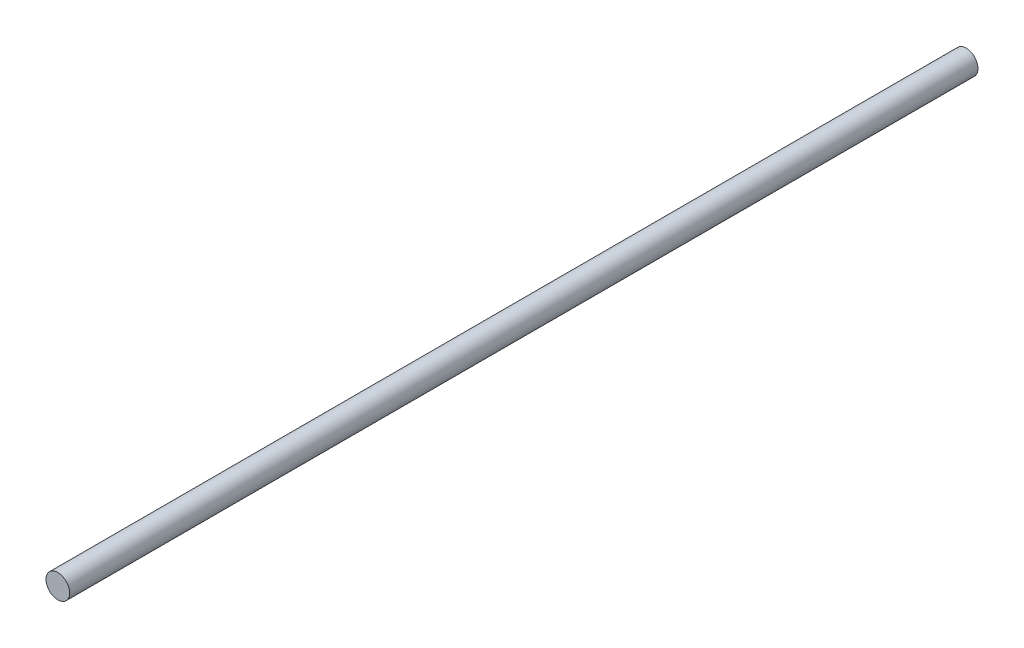
ISO-10303-21;
HEADER;
FILE_DESCRIPTION(('STEP AP214'),'2;1');
FILE_NAME('part.step','',(''),(''),'','','');
FILE_SCHEMA(('AUTOMOTIVE_DESIGN { 1 0 10303 214 1 1 1 1 }'));
ENDSEC;
DATA;
#1=APPLICATION_CONTEXT('core data for automotive mechanical design processes');
#2=APPLICATION_PROTOCOL_DEFINITION('international standard','automotive_design',2000,#1);
#3=PRODUCT_CONTEXT('',#1,'mechanical');
#4=PRODUCT('Part','Part','',(#3));
#5=PRODUCT_RELATED_PRODUCT_CATEGORY('part','',(#4));
#6=PRODUCT_DEFINITION_FORMATION('','',#4);
#7=PRODUCT_DEFINITION_CONTEXT('part definition',#1,'design');
#8=PRODUCT_DEFINITION('design','',#6,#7);
#9=PRODUCT_DEFINITION_SHAPE('','',#8);
#10=(LENGTH_UNIT() NAMED_UNIT(*) SI_UNIT(.MILLI.,.METRE.));
#11=(NAMED_UNIT(*) PLANE_ANGLE_UNIT() SI_UNIT($,.RADIAN.));
#12=(NAMED_UNIT(*) SI_UNIT($,.STERADIAN.) SOLID_ANGLE_UNIT());
#13=UNCERTAINTY_MEASURE_WITH_UNIT(LENGTH_MEASURE(1.E-05),#10,'distance_accuracy_value','');
#14=(GEOMETRIC_REPRESENTATION_CONTEXT(3) GLOBAL_UNCERTAINTY_ASSIGNED_CONTEXT((#13)) GLOBAL_UNIT_ASSIGNED_CONTEXT((#10,
#11,#12)) REPRESENTATION_CONTEXT('',''));
#15=CARTESIAN_POINT('',(0.,0.,0.));
#16=DIRECTION('',(0.,0.,1.));
#17=DIRECTION('',(1.,0.,0.));
#18=AXIS2_PLACEMENT_3D('',#15,#16,#17);
#19=CARTESIAN_POINT('',(0.,0.,230.));
#20=DIRECTION('',(0.,0.,-1.));
#21=DIRECTION('',(-1.,0.,0.));
#22=AXIS2_PLACEMENT_3D('',#19,#20,#21);
#23=CYLINDRICAL_SURFACE('',#22,3.);
#24=CARTESIAN_POINT('',(0.,0.,230.));
#25=DIRECTION('',(0.,0.,1.));
#26=DIRECTION('',(1.,0.,0.));
#27=AXIS2_PLACEMENT_3D('',#24,#25,#26);
#28=CIRCLE('',#27,3.);
#29=CARTESIAN_POINT('',(3.,0.,230.));
#30=VERTEX_POINT('',#29);
#31=EDGE_CURVE('E10',#30,#30,#28,.T.);
#32=ORIENTED_EDGE('',*,*,#31,.F.);
#33=EDGE_LOOP('',(#32));
#34=FACE_BOUND('',#33,.T.);
#35=CARTESIAN_POINT('',(0.,0.,0.));
#36=DIRECTION('',(0.,0.,1.));
#37=DIRECTION('',(1.,0.,0.));
#38=AXIS2_PLACEMENT_3D('',#35,#36,#37);
#39=CIRCLE('',#38,3.);
#40=CARTESIAN_POINT('',(3.,0.,0.));
#41=VERTEX_POINT('',#40);
#42=EDGE_CURVE('E46',#41,#41,#39,.T.);
#43=ORIENTED_EDGE('',*,*,#42,.T.);
#44=EDGE_LOOP('',(#43));
#45=FACE_BOUND('',#44,.T.);
#46=ADVANCED_FACE('F43',(#34,#45),#23,.T.);
#47=CARTESIAN_POINT('',(0.,0.,230.));
#48=DIRECTION('',(0.,0.,1.));
#49=DIRECTION('',(1.,0.,0.));
#50=AXIS2_PLACEMENT_3D('',#47,#48,#49);
#51=PLANE('',#50);
#52=ORIENTED_EDGE('',*,*,#31,.T.);
#53=EDGE_LOOP('',(#52));
#54=FACE_BOUND('',#53,.T.);
#55=ADVANCED_FACE('F60',(#54),#51,.T.);
#56=CARTESIAN_POINT('',(0.,0.,0.));
#57=DIRECTION('',(0.,0.,1.));
#58=DIRECTION('',(1.,0.,0.));
#59=AXIS2_PLACEMENT_3D('',#56,#57,#58);
#60=PLANE('',#59);
#61=ORIENTED_EDGE('',*,*,#42,.F.);
#62=EDGE_LOOP('',(#61));
#63=FACE_BOUND('',#62,.T.);
#64=ADVANCED_FACE('F58',(#63),#60,.F.);
#65=CLOSED_SHELL('',(#46,#55,#64));
#66=MANIFOLD_SOLID_BREP('B2',#65);
#67=ADVANCED_BREP_SHAPE_REPRESENTATION('',(#18,#66),#14);
#68=SHAPE_DEFINITION_REPRESENTATION(#9,#67);
ENDSEC;
END-ISO-10303-21;
